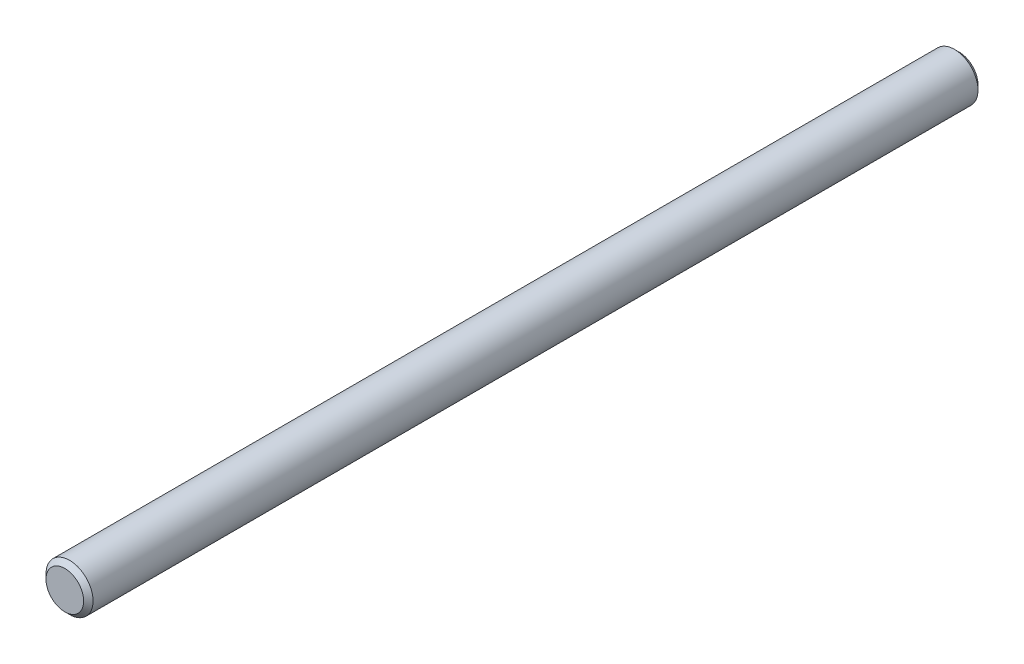
ISO-10303-21;
HEADER;
FILE_DESCRIPTION(('STEP AP214'),'2;1');
FILE_NAME('part.step','',(''),(''),'','','');
FILE_SCHEMA(('AUTOMOTIVE_DESIGN { 1 0 10303 214 1 1 1 1 }'));
ENDSEC;
DATA;
#1=APPLICATION_CONTEXT('core data for automotive mechanical design processes');
#2=APPLICATION_PROTOCOL_DEFINITION('international standard','automotive_design',2000,#1);
#3=PRODUCT_CONTEXT('',#1,'mechanical');
#4=PRODUCT('Part','Part','',(#3));
#5=PRODUCT_RELATED_PRODUCT_CATEGORY('part','',(#4));
#6=PRODUCT_DEFINITION_FORMATION('','',#4);
#7=PRODUCT_DEFINITION_CONTEXT('part definition',#1,'design');
#8=PRODUCT_DEFINITION('design','',#6,#7);
#9=PRODUCT_DEFINITION_SHAPE('','',#8);
#10=(LENGTH_UNIT() NAMED_UNIT(*) SI_UNIT(.MILLI.,.METRE.));
#11=(NAMED_UNIT(*) PLANE_ANGLE_UNIT() SI_UNIT($,.RADIAN.));
#12=(NAMED_UNIT(*) SI_UNIT($,.STERADIAN.) SOLID_ANGLE_UNIT());
#13=UNCERTAINTY_MEASURE_WITH_UNIT(LENGTH_MEASURE(1.E-05),#10,'distance_accuracy_value','');
#14=(GEOMETRIC_REPRESENTATION_CONTEXT(3) GLOBAL_UNCERTAINTY_ASSIGNED_CONTEXT((#13)) GLOBAL_UNIT_ASSIGNED_CONTEXT((#10,
#11,#12)) REPRESENTATION_CONTEXT('',''));
#15=CARTESIAN_POINT('',(0.,0.,0.));
#16=DIRECTION('',(0.,0.,1.));
#17=DIRECTION('',(1.,0.,0.));
#18=AXIS2_PLACEMENT_3D('',#15,#16,#17);
#19=CARTESIAN_POINT('',(0.,0.,60.325));
#20=DIRECTION('',(0.,0.,-1.));
#21=DIRECTION('',(-1.,0.,0.));
#22=AXIS2_PLACEMENT_3D('',#19,#20,#21);
#23=CYLINDRICAL_SURFACE('',#22,3.175);
#24=CARTESIAN_POINT('',(0.,0.,-59.6899999999999));
#25=DIRECTION('',(0.,0.,1.));
#26=DIRECTION('',(1.,0.,0.));
#27=AXIS2_PLACEMENT_3D('',#24,#25,#26);
#28=CIRCLE('',#27,3.175);
#29=CARTESIAN_POINT('',(3.175,0.,-59.6899999999999));
#30=VERTEX_POINT('',#29);
#31=EDGE_CURVE('E44',#30,#30,#28,.T.);
#32=ORIENTED_EDGE('',*,*,#31,.T.);
#33=EDGE_LOOP('',(#32));
#34=FACE_BOUND('',#33,.T.);
#35=CARTESIAN_POINT('',(0.,0.,59.6900000000001));
#36=DIRECTION('',(0.,0.,1.));
#37=DIRECTION('',(1.,0.,0.));
#38=AXIS2_PLACEMENT_3D('',#35,#36,#37);
#39=CIRCLE('',#38,3.175);
#40=CARTESIAN_POINT('',(3.175,0.,59.6900000000001));
#41=VERTEX_POINT('',#40);
#42=EDGE_CURVE('E48',#41,#41,#39,.F.);
#43=ORIENTED_EDGE('',*,*,#42,.T.);
#44=EDGE_LOOP('',(#43));
#45=FACE_BOUND('',#44,.T.);
#46=ADVANCED_FACE('F33',(#34,#45),#23,.T.);
#47=CARTESIAN_POINT('',(0.,0.,60.325));
#48=DIRECTION('',(0.,0.,1.));
#49=DIRECTION('',(1.,0.,0.));
#50=AXIS2_PLACEMENT_3D('',#47,#48,#49);
#51=PLANE('',#50);
#52=CARTESIAN_POINT('',(0.,0.,60.325));
#53=DIRECTION('',(0.,0.,1.));
#54=DIRECTION('',(1.,0.,0.));
#55=AXIS2_PLACEMENT_3D('',#52,#53,#54);
#56=CIRCLE('',#55,2.54000000000008);
#57=CARTESIAN_POINT('',(2.54000000000008,0.,60.325));
#58=VERTEX_POINT('',#57);
#59=EDGE_CURVE('E10',#58,#58,#56,.T.);
#60=ORIENTED_EDGE('',*,*,#59,.T.);
#61=EDGE_LOOP('',(#60));
#62=FACE_BOUND('',#61,.T.);
#63=ADVANCED_FACE('F64',(#62),#51,.T.);
#64=CARTESIAN_POINT('',(0.,0.,-60.325));
#65=DIRECTION('',(0.,0.,1.));
#66=DIRECTION('',(1.,0.,0.));
#67=AXIS2_PLACEMENT_3D('',#64,#65,#66);
#68=PLANE('',#67);
#69=CARTESIAN_POINT('',(0.,0.,-60.325));
#70=DIRECTION('',(0.,0.,1.));
#71=DIRECTION('',(1.,0.,0.));
#72=AXIS2_PLACEMENT_3D('',#69,#70,#71);
#73=CIRCLE('',#72,2.53999999999989);
#74=CARTESIAN_POINT('',(2.53999999999989,0.,-60.325));
#75=VERTEX_POINT('',#74);
#76=EDGE_CURVE('E40',#75,#75,#73,.F.);
#77=ORIENTED_EDGE('',*,*,#76,.T.);
#78=EDGE_LOOP('',(#77));
#79=FACE_BOUND('',#78,.T.);
#80=ADVANCED_FACE('F61',(#79),#68,.F.);
#81=CARTESIAN_POINT('',(0.,0.,-59.6899999999999));
#82=DIRECTION('',(0.,0.,1.));
#83=DIRECTION('',(1.,0.,0.));
#84=AXIS2_PLACEMENT_3D('',#81,#82,#83);
#85=CONICAL_SURFACE('',#84,3.175,0.785398163397451);
#86=ORIENTED_EDGE('',*,*,#76,.F.);
#87=EDGE_LOOP('',(#86));
#88=FACE_BOUND('',#87,.T.);
#89=ORIENTED_EDGE('',*,*,#31,.F.);
#90=EDGE_LOOP('',(#89));
#91=FACE_BOUND('',#90,.T.);
#92=ADVANCED_FACE('F57',(#88,#91),#85,.T.);
#93=CARTESIAN_POINT('',(0.,0.,60.325));
#94=DIRECTION('',(0.,0.,-1.));
#95=DIRECTION('',(-1.,0.,0.));
#96=AXIS2_PLACEMENT_3D('',#93,#94,#95);
#97=CONICAL_SURFACE('',#96,2.54000000000008,0.785398163397445);
#98=ORIENTED_EDGE('',*,*,#42,.F.);
#99=EDGE_LOOP('',(#98));
#100=FACE_BOUND('',#99,.T.);
#101=ORIENTED_EDGE('',*,*,#59,.F.);
#102=EDGE_LOOP('',(#101));
#103=FACE_BOUND('',#102,.T.);
#104=ADVANCED_FACE('F35',(#100,#103),#97,.T.);
#105=CLOSED_SHELL('',(#46,#63,#80,#92,#104));
#106=MANIFOLD_SOLID_BREP('B2',#105);
#107=ADVANCED_BREP_SHAPE_REPRESENTATION('',(#18,#106),#14);
#108=SHAPE_DEFINITION_REPRESENTATION(#9,#107);
ENDSEC;
END-ISO-10303-21;
